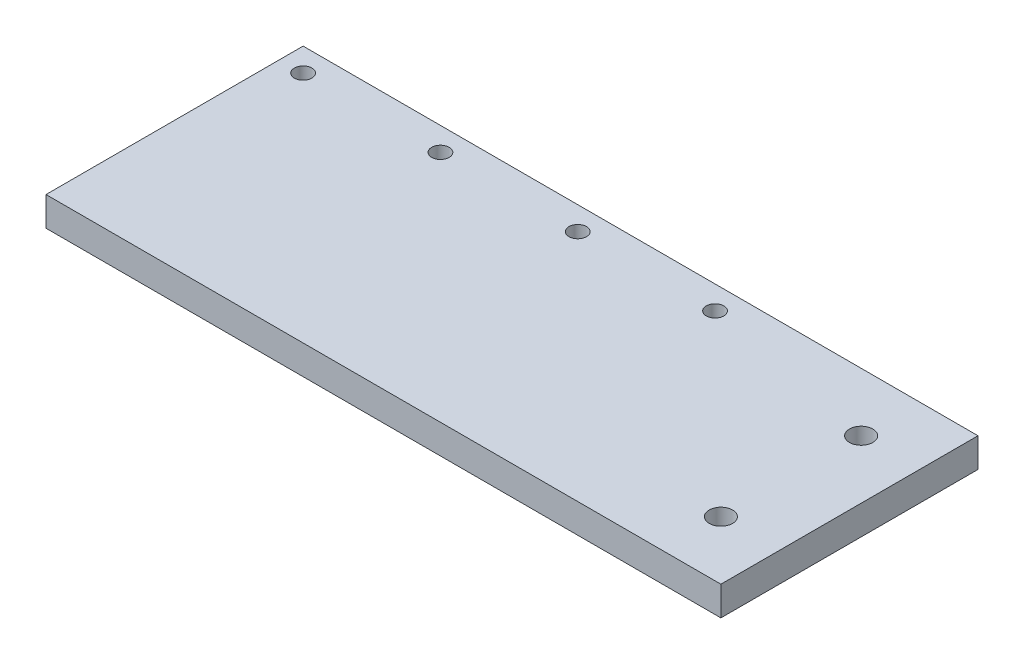
ISO-10303-21;
HEADER;
FILE_DESCRIPTION(('STEP AP214'),'2;1');
FILE_NAME('part.step','',(''),(''),'','','');
FILE_SCHEMA(('AUTOMOTIVE_DESIGN { 1 0 10303 214 1 1 1 1 }'));
ENDSEC;
DATA;
#1=APPLICATION_CONTEXT('core data for automotive mechanical design processes');
#2=APPLICATION_PROTOCOL_DEFINITION('international standard','automotive_design',2000,#1);
#3=PRODUCT_CONTEXT('',#1,'mechanical');
#4=PRODUCT('Part','Part','',(#3));
#5=PRODUCT_RELATED_PRODUCT_CATEGORY('part','',(#4));
#6=PRODUCT_DEFINITION_FORMATION('','',#4);
#7=PRODUCT_DEFINITION_CONTEXT('part definition',#1,'design');
#8=PRODUCT_DEFINITION('design','',#6,#7);
#9=PRODUCT_DEFINITION_SHAPE('','',#8);
#10=(LENGTH_UNIT() NAMED_UNIT(*) SI_UNIT(.MILLI.,.METRE.));
#11=(NAMED_UNIT(*) PLANE_ANGLE_UNIT() SI_UNIT($,.RADIAN.));
#12=(NAMED_UNIT(*) SI_UNIT($,.STERADIAN.) SOLID_ANGLE_UNIT());
#13=UNCERTAINTY_MEASURE_WITH_UNIT(LENGTH_MEASURE(1.E-05),#10,'distance_accuracy_value','');
#14=(GEOMETRIC_REPRESENTATION_CONTEXT(3) GLOBAL_UNCERTAINTY_ASSIGNED_CONTEXT((#13)) GLOBAL_UNIT_ASSIGNED_CONTEXT((#10,
#11,#12)) REPRESENTATION_CONTEXT('',''));
#15=CARTESIAN_POINT('',(0.,0.,0.));
#16=DIRECTION('',(0.,0.,1.));
#17=DIRECTION('',(1.,0.,0.));
#18=AXIS2_PLACEMENT_3D('',#15,#16,#17);
#19=CARTESIAN_POINT('',(-47.75,5.,-22.));
#20=DIRECTION('',(0.,0.,1.));
#21=DIRECTION('',(1.,0.,0.));
#22=AXIS2_PLACEMENT_3D('',#19,#20,#21);
#23=PLANE('',#22);
#24=DIRECTION('',(-1.,0.,0.));
#25=VECTOR('',#24,1.);
#26=CARTESIAN_POINT('',(-47.75,0.,-22.));
#27=LINE('',#26,#25);
#28=CARTESIAN_POINT('',(67.75,0.,-22.));
#29=VERTEX_POINT('',#28);
#30=CARTESIAN_POINT('',(-47.75,0.,-22.));
#31=VERTEX_POINT('',#30);
#32=EDGE_CURVE('E67',#29,#31,#27,.T.);
#33=ORIENTED_EDGE('',*,*,#32,.T.);
#34=DIRECTION('',(0.,-1.,0.));
#35=VECTOR('',#34,1.);
#36=CARTESIAN_POINT('',(-47.75,5.,-22.));
#37=LINE('',#36,#35);
#38=CARTESIAN_POINT('',(-47.75,5.,-22.));
#39=VERTEX_POINT('',#38);
#40=EDGE_CURVE('E11',#39,#31,#37,.T.);
#41=ORIENTED_EDGE('',*,*,#40,.F.);
#42=DIRECTION('',(-1.,0.,0.));
#43=VECTOR('',#42,1.);
#44=CARTESIAN_POINT('',(-47.75,5.,-22.));
#45=LINE('',#44,#43);
#46=CARTESIAN_POINT('',(67.75,5.,-22.));
#47=VERTEX_POINT('',#46);
#48=EDGE_CURVE('E80',#47,#39,#45,.T.);
#49=ORIENTED_EDGE('',*,*,#48,.F.);
#50=DIRECTION('',(0.,1.,0.));
#51=VECTOR('',#50,1.);
#52=CARTESIAN_POINT('',(67.75,0.,-22.));
#53=LINE('',#52,#51);
#54=EDGE_CURVE('E82',#29,#47,#53,.T.);
#55=ORIENTED_EDGE('',*,*,#54,.F.);
#56=EDGE_LOOP('',(#33,#41,#49,#55));
#57=FACE_BOUND('',#56,.T.);
#58=ADVANCED_FACE('F39',(#57),#23,.F.);
#59=CARTESIAN_POINT('',(-47.75,5.,-22.));
#60=DIRECTION('',(1.,0.,0.));
#61=DIRECTION('',(0.,0.,-1.));
#62=AXIS2_PLACEMENT_3D('',#59,#60,#61);
#63=PLANE('',#62);
#64=DIRECTION('',(0.,0.,1.));
#65=VECTOR('',#64,1.);
#66=CARTESIAN_POINT('',(-47.75,0.,-22.));
#67=LINE('',#66,#65);
#68=CARTESIAN_POINT('',(-47.75,0.,22.));
#69=VERTEX_POINT('',#68);
#70=EDGE_CURVE('E153',#31,#69,#67,.T.);
#71=ORIENTED_EDGE('',*,*,#70,.T.);
#72=DIRECTION('',(0.,-1.,0.));
#73=VECTOR('',#72,1.);
#74=CARTESIAN_POINT('',(-47.75,5.,22.));
#75=LINE('',#74,#73);
#76=CARTESIAN_POINT('',(-47.75,5.,22.));
#77=VERTEX_POINT('',#76);
#78=EDGE_CURVE('E48',#77,#69,#75,.T.);
#79=ORIENTED_EDGE('',*,*,#78,.F.);
#80=DIRECTION('',(0.,0.,1.));
#81=VECTOR('',#80,1.);
#82=CARTESIAN_POINT('',(-47.75,5.,-22.));
#83=LINE('',#82,#81);
#84=EDGE_CURVE('E56',#39,#77,#83,.T.);
#85=ORIENTED_EDGE('',*,*,#84,.F.);
#86=ORIENTED_EDGE('',*,*,#40,.T.);
#87=EDGE_LOOP('',(#71,#79,#85,#86));
#88=FACE_BOUND('',#87,.T.);
#89=ADVANCED_FACE('F165',(#88),#63,.F.);
#90=CARTESIAN_POINT('',(-47.75,5.,22.));
#91=DIRECTION('',(0.,0.,-1.));
#92=DIRECTION('',(-1.,0.,0.));
#93=AXIS2_PLACEMENT_3D('',#90,#91,#92);
#94=PLANE('',#93);
#95=DIRECTION('',(1.,0.,0.));
#96=VECTOR('',#95,1.);
#97=CARTESIAN_POINT('',(-47.75,0.,22.));
#98=LINE('',#97,#96);
#99=CARTESIAN_POINT('',(67.75,0.,22.));
#100=VERTEX_POINT('',#99);
#101=EDGE_CURVE('E86',#69,#100,#98,.T.);
#102=ORIENTED_EDGE('',*,*,#101,.T.);
#103=DIRECTION('',(0.,1.,0.));
#104=VECTOR('',#103,1.);
#105=CARTESIAN_POINT('',(67.75,0.,22.));
#106=LINE('',#105,#104);
#107=CARTESIAN_POINT('',(67.75,5.,22.));
#108=VERTEX_POINT('',#107);
#109=EDGE_CURVE('E96',#100,#108,#106,.T.);
#110=ORIENTED_EDGE('',*,*,#109,.T.);
#111=DIRECTION('',(1.,0.,0.));
#112=VECTOR('',#111,1.);
#113=CARTESIAN_POINT('',(-47.75,5.,22.));
#114=LINE('',#113,#112);
#115=EDGE_CURVE('E101',#77,#108,#114,.T.);
#116=ORIENTED_EDGE('',*,*,#115,.F.);
#117=ORIENTED_EDGE('',*,*,#78,.T.);
#118=EDGE_LOOP('',(#102,#110,#116,#117));
#119=FACE_BOUND('',#118,.T.);
#120=ADVANCED_FACE('F161',(#119),#94,.F.);
#121=CARTESIAN_POINT('',(0.,5.,0.));
#122=DIRECTION('',(0.,1.,0.));
#123=DIRECTION('',(0.,0.,1.));
#124=AXIS2_PLACEMENT_3D('',#121,#122,#123);
#125=PLANE('',#124);
#126=CARTESIAN_POINT('',(-43.75,5.,-18.));
#127=DIRECTION('',(0.,1.,0.));
#128=DIRECTION('',(0.,0.,1.));
#129=AXIS2_PLACEMENT_3D('',#126,#127,#128);
#130=CIRCLE('',#129,1.5);
#131=CARTESIAN_POINT('',(-43.75,5.,-16.5));
#132=VERTEX_POINT('',#131);
#133=EDGE_CURVE('E120',#132,#132,#130,.T.);
#134=ORIENTED_EDGE('',*,*,#133,.F.);
#135=EDGE_LOOP('',(#134));
#136=FACE_BOUND('',#135,.T.);
#137=CARTESIAN_POINT('',(-20.25,5.,-18.));
#138=DIRECTION('',(0.,1.,0.));
#139=DIRECTION('',(0.,0.,1.));
#140=AXIS2_PLACEMENT_3D('',#137,#138,#139);
#141=CIRCLE('',#140,1.5);
#142=CARTESIAN_POINT('',(-20.25,5.,-16.5));
#143=VERTEX_POINT('',#142);
#144=EDGE_CURVE('E128',#143,#143,#141,.T.);
#145=ORIENTED_EDGE('',*,*,#144,.F.);
#146=EDGE_LOOP('',(#145));
#147=FACE_BOUND('',#146,.T.);
#148=CARTESIAN_POINT('',(3.25,5.,-18.));
#149=DIRECTION('',(0.,1.,0.));
#150=DIRECTION('',(0.,0.,1.));
#151=AXIS2_PLACEMENT_3D('',#148,#149,#150);
#152=CIRCLE('',#151,1.5);
#153=CARTESIAN_POINT('',(3.25,5.,-16.5));
#154=VERTEX_POINT('',#153);
#155=EDGE_CURVE('E136',#154,#154,#152,.T.);
#156=ORIENTED_EDGE('',*,*,#155,.F.);
#157=EDGE_LOOP('',(#156));
#158=FACE_BOUND('',#157,.T.);
#159=CARTESIAN_POINT('',(26.75,5.,-18.));
#160=DIRECTION('',(0.,1.,0.));
#161=DIRECTION('',(0.,0.,1.));
#162=AXIS2_PLACEMENT_3D('',#159,#160,#161);
#163=CIRCLE('',#162,1.5);
#164=CARTESIAN_POINT('',(26.75,5.,-16.5));
#165=VERTEX_POINT('',#164);
#166=EDGE_CURVE('E95',#165,#165,#163,.T.);
#167=ORIENTED_EDGE('',*,*,#166,.F.);
#168=EDGE_LOOP('',(#167));
#169=FACE_BOUND('',#168,.T.);
#170=ORIENTED_EDGE('',*,*,#115,.T.);
#171=DIRECTION('',(0.,0.,-1.));
#172=VECTOR('',#171,1.);
#173=CARTESIAN_POINT('',(67.75,5.,-22.));
#174=LINE('',#173,#172);
#175=EDGE_CURVE('E92',#108,#47,#174,.T.);
#176=ORIENTED_EDGE('',*,*,#175,.T.);
#177=ORIENTED_EDGE('',*,*,#48,.T.);
#178=ORIENTED_EDGE('',*,*,#84,.T.);
#179=EDGE_LOOP('',(#170,#176,#177,#178));
#180=FACE_BOUND('',#179,.T.);
#181=CARTESIAN_POINT('',(57.75,5.,12.));
#182=DIRECTION('',(0.,1.,0.));
#183=DIRECTION('',(0.,0.,1.));
#184=AXIS2_PLACEMENT_3D('',#181,#182,#183);
#185=CIRCLE('',#184,2.);
#186=CARTESIAN_POINT('',(57.75,5.,14.));
#187=VERTEX_POINT('',#186);
#188=EDGE_CURVE('E212',#187,#187,#185,.T.);
#189=ORIENTED_EDGE('',*,*,#188,.F.);
#190=EDGE_LOOP('',(#189));
#191=FACE_BOUND('',#190,.T.);
#192=CARTESIAN_POINT('',(57.75,5.,-12.));
#193=DIRECTION('',(0.,1.,0.));
#194=DIRECTION('',(0.,0.,1.));
#195=AXIS2_PLACEMENT_3D('',#192,#193,#194);
#196=CIRCLE('',#195,2.);
#197=CARTESIAN_POINT('',(57.75,5.,-9.99999999999999));
#198=VERTEX_POINT('',#197);
#199=EDGE_CURVE('E110',#198,#198,#196,.T.);
#200=ORIENTED_EDGE('',*,*,#199,.F.);
#201=EDGE_LOOP('',(#200));
#202=FACE_BOUND('',#201,.T.);
#203=ADVANCED_FACE('F98',(#136,#147,#158,#169,#180,#191,#202),#125,.T.);
#204=CARTESIAN_POINT('',(0.,0.,0.));
#205=DIRECTION('',(0.,1.,0.));
#206=DIRECTION('',(0.,0.,1.));
#207=AXIS2_PLACEMENT_3D('',#204,#205,#206);
#208=PLANE('',#207);
#209=CARTESIAN_POINT('',(-43.75,0.,-18.));
#210=DIRECTION('',(0.,1.,0.));
#211=DIRECTION('',(0.,0.,1.));
#212=AXIS2_PLACEMENT_3D('',#209,#210,#211);
#213=CIRCLE('',#212,1.5);
#214=CARTESIAN_POINT('',(-43.75,0.,-16.5));
#215=VERTEX_POINT('',#214);
#216=EDGE_CURVE('E116',#215,#215,#213,.T.);
#217=ORIENTED_EDGE('',*,*,#216,.T.);
#218=EDGE_LOOP('',(#217));
#219=FACE_BOUND('',#218,.T.);
#220=CARTESIAN_POINT('',(-20.25,0.,-18.));
#221=DIRECTION('',(0.,1.,0.));
#222=DIRECTION('',(0.,0.,1.));
#223=AXIS2_PLACEMENT_3D('',#220,#221,#222);
#224=CIRCLE('',#223,1.5);
#225=CARTESIAN_POINT('',(-20.25,0.,-16.5));
#226=VERTEX_POINT('',#225);
#227=EDGE_CURVE('E124',#226,#226,#224,.T.);
#228=ORIENTED_EDGE('',*,*,#227,.T.);
#229=EDGE_LOOP('',(#228));
#230=FACE_BOUND('',#229,.T.);
#231=CARTESIAN_POINT('',(3.25,0.,-18.));
#232=DIRECTION('',(0.,1.,0.));
#233=DIRECTION('',(0.,0.,1.));
#234=AXIS2_PLACEMENT_3D('',#231,#232,#233);
#235=CIRCLE('',#234,1.5);
#236=CARTESIAN_POINT('',(3.25,0.,-16.5));
#237=VERTEX_POINT('',#236);
#238=EDGE_CURVE('E132',#237,#237,#235,.T.);
#239=ORIENTED_EDGE('',*,*,#238,.T.);
#240=EDGE_LOOP('',(#239));
#241=FACE_BOUND('',#240,.T.);
#242=CARTESIAN_POINT('',(26.75,0.,-18.));
#243=DIRECTION('',(0.,1.,0.));
#244=DIRECTION('',(0.,0.,1.));
#245=AXIS2_PLACEMENT_3D('',#242,#243,#244);
#246=CIRCLE('',#245,1.5);
#247=CARTESIAN_POINT('',(26.75,0.,-16.5));
#248=VERTEX_POINT('',#247);
#249=EDGE_CURVE('E140',#248,#248,#246,.T.);
#250=ORIENTED_EDGE('',*,*,#249,.T.);
#251=EDGE_LOOP('',(#250));
#252=FACE_BOUND('',#251,.T.);
#253=ORIENTED_EDGE('',*,*,#32,.F.);
#254=DIRECTION('',(0.,0.,-1.));
#255=VECTOR('',#254,1.);
#256=CARTESIAN_POINT('',(67.75,0.,-22.));
#257=LINE('',#256,#255);
#258=EDGE_CURVE('E93',#100,#29,#257,.T.);
#259=ORIENTED_EDGE('',*,*,#258,.F.);
#260=ORIENTED_EDGE('',*,*,#101,.F.);
#261=ORIENTED_EDGE('',*,*,#70,.F.);
#262=EDGE_LOOP('',(#253,#259,#260,#261));
#263=FACE_BOUND('',#262,.T.);
#264=CARTESIAN_POINT('',(57.75,0.,12.));
#265=DIRECTION('',(0.,1.,0.));
#266=DIRECTION('',(0.,0.,1.));
#267=AXIS2_PLACEMENT_3D('',#264,#265,#266);
#268=CIRCLE('',#267,2.);
#269=CARTESIAN_POINT('',(57.75,0.,14.));
#270=VERTEX_POINT('',#269);
#271=EDGE_CURVE('E209',#270,#270,#268,.T.);
#272=ORIENTED_EDGE('',*,*,#271,.T.);
#273=EDGE_LOOP('',(#272));
#274=FACE_BOUND('',#273,.T.);
#275=CARTESIAN_POINT('',(57.75,0.,-12.));
#276=DIRECTION('',(0.,1.,0.));
#277=DIRECTION('',(0.,0.,1.));
#278=AXIS2_PLACEMENT_3D('',#275,#276,#277);
#279=CIRCLE('',#278,2.);
#280=CARTESIAN_POINT('',(57.75,0.,-9.99999999999999));
#281=VERTEX_POINT('',#280);
#282=EDGE_CURVE('E104',#281,#281,#279,.T.);
#283=ORIENTED_EDGE('',*,*,#282,.T.);
#284=EDGE_LOOP('',(#283));
#285=FACE_BOUND('',#284,.T.);
#286=ADVANCED_FACE('F163',(#219,#230,#241,#252,#263,#274,#285),#208,.F.);
#287=CARTESIAN_POINT('',(26.75,0.,-18.));
#288=DIRECTION('',(0.,1.,0.));
#289=DIRECTION('',(0.,0.,1.));
#290=AXIS2_PLACEMENT_3D('',#287,#288,#289);
#291=CYLINDRICAL_SURFACE('',#290,1.5);
#292=ORIENTED_EDGE('',*,*,#249,.F.);
#293=EDGE_LOOP('',(#292));
#294=FACE_BOUND('',#293,.T.);
#295=ORIENTED_EDGE('',*,*,#166,.T.);
#296=EDGE_LOOP('',(#295));
#297=FACE_BOUND('',#296,.T.);
#298=ADVANCED_FACE('F175',(#294,#297),#291,.F.);
#299=CARTESIAN_POINT('',(3.25,0.,-18.));
#300=DIRECTION('',(0.,1.,0.));
#301=DIRECTION('',(0.,0.,1.));
#302=AXIS2_PLACEMENT_3D('',#299,#300,#301);
#303=CYLINDRICAL_SURFACE('',#302,1.5);
#304=ORIENTED_EDGE('',*,*,#238,.F.);
#305=EDGE_LOOP('',(#304));
#306=FACE_BOUND('',#305,.T.);
#307=ORIENTED_EDGE('',*,*,#155,.T.);
#308=EDGE_LOOP('',(#307));
#309=FACE_BOUND('',#308,.T.);
#310=ADVANCED_FACE('F182',(#306,#309),#303,.F.);
#311=CARTESIAN_POINT('',(-20.25,0.,-18.));
#312=DIRECTION('',(0.,1.,0.));
#313=DIRECTION('',(0.,0.,1.));
#314=AXIS2_PLACEMENT_3D('',#311,#312,#313);
#315=CYLINDRICAL_SURFACE('',#314,1.5);
#316=ORIENTED_EDGE('',*,*,#227,.F.);
#317=EDGE_LOOP('',(#316));
#318=FACE_BOUND('',#317,.T.);
#319=ORIENTED_EDGE('',*,*,#144,.T.);
#320=EDGE_LOOP('',(#319));
#321=FACE_BOUND('',#320,.T.);
#322=ADVANCED_FACE('F186',(#318,#321),#315,.F.);
#323=CARTESIAN_POINT('',(-43.75,0.,-18.));
#324=DIRECTION('',(0.,1.,0.));
#325=DIRECTION('',(0.,0.,1.));
#326=AXIS2_PLACEMENT_3D('',#323,#324,#325);
#327=CYLINDRICAL_SURFACE('',#326,1.5);
#328=ORIENTED_EDGE('',*,*,#216,.F.);
#329=EDGE_LOOP('',(#328));
#330=FACE_BOUND('',#329,.T.);
#331=ORIENTED_EDGE('',*,*,#133,.T.);
#332=EDGE_LOOP('',(#331));
#333=FACE_BOUND('',#332,.T.);
#334=ADVANCED_FACE('F190',(#330,#333),#327,.F.);
#335=CARTESIAN_POINT('',(67.75,0.,-22.));
#336=DIRECTION('',(1.,0.,0.));
#337=DIRECTION('',(0.,0.,-1.));
#338=AXIS2_PLACEMENT_3D('',#335,#336,#337);
#339=PLANE('',#338);
#340=ORIENTED_EDGE('',*,*,#175,.F.);
#341=ORIENTED_EDGE('',*,*,#109,.F.);
#342=ORIENTED_EDGE('',*,*,#258,.T.);
#343=ORIENTED_EDGE('',*,*,#54,.T.);
#344=EDGE_LOOP('',(#340,#341,#342,#343));
#345=FACE_BOUND('',#344,.T.);
#346=ADVANCED_FACE('F90',(#345),#339,.T.);
#347=CARTESIAN_POINT('',(57.75,0.,-12.));
#348=DIRECTION('',(0.,1.,0.));
#349=DIRECTION('',(0.,0.,1.));
#350=AXIS2_PLACEMENT_3D('',#347,#348,#349);
#351=CYLINDRICAL_SURFACE('',#350,2.);
#352=ORIENTED_EDGE('',*,*,#282,.F.);
#353=EDGE_LOOP('',(#352));
#354=FACE_BOUND('',#353,.T.);
#355=ORIENTED_EDGE('',*,*,#199,.T.);
#356=EDGE_LOOP('',(#355));
#357=FACE_BOUND('',#356,.T.);
#358=ADVANCED_FACE('F197',(#354,#357),#351,.F.);
#359=CARTESIAN_POINT('',(57.75,0.,12.));
#360=DIRECTION('',(0.,1.,0.));
#361=DIRECTION('',(0.,0.,1.));
#362=AXIS2_PLACEMENT_3D('',#359,#360,#361);
#363=CYLINDRICAL_SURFACE('',#362,2.);
#364=ORIENTED_EDGE('',*,*,#271,.F.);
#365=EDGE_LOOP('',(#364));
#366=FACE_BOUND('',#365,.T.);
#367=ORIENTED_EDGE('',*,*,#188,.T.);
#368=EDGE_LOOP('',(#367));
#369=FACE_BOUND('',#368,.T.);
#370=ADVANCED_FACE('F200',(#366,#369),#363,.F.);
#371=CLOSED_SHELL('',(#58,#89,#120,#203,#286,#298,#310,#322,#334,#346,#358,#370));
#372=MANIFOLD_SOLID_BREP('B2',#371);
#373=ADVANCED_BREP_SHAPE_REPRESENTATION('',(#18,#372),#14);
#374=SHAPE_DEFINITION_REPRESENTATION(#9,#373);
ENDSEC;
END-ISO-10303-21;
